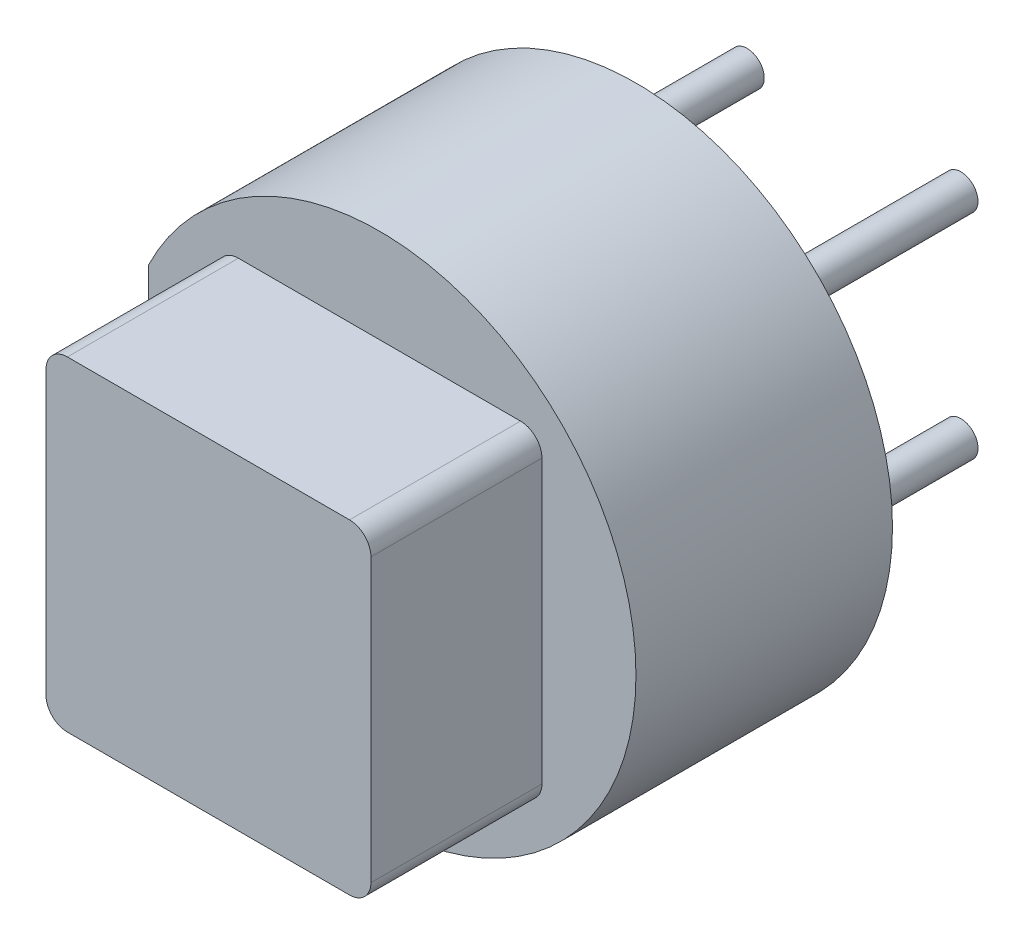
ISO-10303-21;
HEADER;
FILE_DESCRIPTION(('STEP AP214'),'2;1');
FILE_NAME('part.step','',(''),(''),'','','');
FILE_SCHEMA(('AUTOMOTIVE_DESIGN { 1 0 10303 214 1 1 1 1 }'));
ENDSEC;
DATA;
#1=APPLICATION_CONTEXT('core data for automotive mechanical design processes');
#2=APPLICATION_PROTOCOL_DEFINITION('international standard','automotive_design',2000,#1);
#3=PRODUCT_CONTEXT('',#1,'mechanical');
#4=PRODUCT('Part','Part','',(#3));
#5=PRODUCT_RELATED_PRODUCT_CATEGORY('part','',(#4));
#6=PRODUCT_DEFINITION_FORMATION('','',#4);
#7=PRODUCT_DEFINITION_CONTEXT('part definition',#1,'design');
#8=PRODUCT_DEFINITION('design','',#6,#7);
#9=PRODUCT_DEFINITION_SHAPE('','',#8);
#10=(LENGTH_UNIT() NAMED_UNIT(*) SI_UNIT(.MILLI.,.METRE.));
#11=(NAMED_UNIT(*) PLANE_ANGLE_UNIT() SI_UNIT($,.RADIAN.));
#12=(NAMED_UNIT(*) SI_UNIT($,.STERADIAN.) SOLID_ANGLE_UNIT());
#13=UNCERTAINTY_MEASURE_WITH_UNIT(LENGTH_MEASURE(1.E-05),#10,'distance_accuracy_value','');
#14=(GEOMETRIC_REPRESENTATION_CONTEXT(3) GLOBAL_UNCERTAINTY_ASSIGNED_CONTEXT((#13)) GLOBAL_UNIT_ASSIGNED_CONTEXT((#10,
#11,#12)) REPRESENTATION_CONTEXT('',''));
#15=CARTESIAN_POINT('',(0.,0.,0.));
#16=DIRECTION('',(0.,0.,1.));
#17=DIRECTION('',(1.,0.,0.));
#18=AXIS2_PLACEMENT_3D('',#15,#16,#17);
#19=CARTESIAN_POINT('',(0.,0.,6.));
#20=DIRECTION('',(0.,0.,-1.));
#21=DIRECTION('',(-1.,0.,0.));
#22=AXIS2_PLACEMENT_3D('',#19,#20,#21);
#23=PLANE('',#22);
#24=CARTESIAN_POINT('',(0.,0.,6.));
#25=DIRECTION('',(0.,0.,1.));
#26=DIRECTION('',(-1.,0.,0.));
#27=AXIS2_PLACEMENT_3D('',#24,#25,#26);
#28=CIRCLE('',#27,6.);
#29=CARTESIAN_POINT('',(-5.4,-2.6153393661244,6.));
#30=VERTEX_POINT('',#29);
#31=CARTESIAN_POINT('',(-5.4,2.6153393661244,6.));
#32=VERTEX_POINT('',#31);
#33=EDGE_CURVE('E193',#30,#32,#28,.T.);
#34=ORIENTED_EDGE('',*,*,#33,.T.);
#35=DIRECTION('',(0.,-1.,0.));
#36=VECTOR('',#35,1.);
#37=CARTESIAN_POINT('',(-5.4,2.6153393661244,6.));
#38=LINE('',#37,#36);
#39=EDGE_CURVE('E197',#32,#30,#38,.T.);
#40=ORIENTED_EDGE('',*,*,#39,.T.);
#41=EDGE_LOOP('',(#34,#40));
#42=FACE_BOUND('',#41,.T.);
#43=DIRECTION('',(0.,1.,0.));
#44=VECTOR('',#43,1.);
#45=CARTESIAN_POINT('',(3.8,-3.8,6.));
#46=LINE('',#45,#44);
#47=CARTESIAN_POINT('',(3.8,-3.3,6.));
#48=VERTEX_POINT('',#47);
#49=CARTESIAN_POINT('',(3.8,3.3,6.));
#50=VERTEX_POINT('',#49);
#51=EDGE_CURVE('E160',#48,#50,#46,.T.);
#52=ORIENTED_EDGE('',*,*,#51,.F.);
#53=CARTESIAN_POINT('',(3.3,-3.3,6.));
#54=DIRECTION('',(0.,0.,-1.));
#55=DIRECTION('',(-1.,0.,0.));
#56=AXIS2_PLACEMENT_3D('',#53,#54,#55);
#57=CIRCLE('',#56,0.5);
#58=CARTESIAN_POINT('',(3.3,-3.8,6.));
#59=VERTEX_POINT('',#58);
#60=EDGE_CURVE('E11',#48,#59,#57,.T.);
#61=ORIENTED_EDGE('',*,*,#60,.T.);
#62=DIRECTION('',(1.,0.,0.));
#63=VECTOR('',#62,1.);
#64=CARTESIAN_POINT('',(-3.8,-3.8,6.));
#65=LINE('',#64,#63);
#66=CARTESIAN_POINT('',(-3.3,-3.8,6.));
#67=VERTEX_POINT('',#66);
#68=EDGE_CURVE('E167',#67,#59,#65,.T.);
#69=ORIENTED_EDGE('',*,*,#68,.F.);
#70=CARTESIAN_POINT('',(-3.3,-3.3,6.));
#71=DIRECTION('',(0.,0.,-1.));
#72=DIRECTION('',(-1.,0.,0.));
#73=AXIS2_PLACEMENT_3D('',#70,#71,#72);
#74=CIRCLE('',#73,0.5);
#75=CARTESIAN_POINT('',(-3.8,-3.3,6.));
#76=VERTEX_POINT('',#75);
#77=EDGE_CURVE('E289',#67,#76,#74,.T.);
#78=ORIENTED_EDGE('',*,*,#77,.T.);
#79=DIRECTION('',(0.,-1.,0.));
#80=VECTOR('',#79,1.);
#81=CARTESIAN_POINT('',(-3.8,-3.8,6.));
#82=LINE('',#81,#80);
#83=CARTESIAN_POINT('',(-3.8,3.3,6.));
#84=VERTEX_POINT('',#83);
#85=EDGE_CURVE('E186',#84,#76,#82,.T.);
#86=ORIENTED_EDGE('',*,*,#85,.F.);
#87=CARTESIAN_POINT('',(-3.3,3.3,6.));
#88=DIRECTION('',(0.,0.,-1.));
#89=DIRECTION('',(-1.,0.,0.));
#90=AXIS2_PLACEMENT_3D('',#87,#88,#89);
#91=CIRCLE('',#90,0.5);
#92=CARTESIAN_POINT('',(-3.3,3.8,6.));
#93=VERTEX_POINT('',#92);
#94=EDGE_CURVE('E292',#84,#93,#91,.T.);
#95=ORIENTED_EDGE('',*,*,#94,.T.);
#96=DIRECTION('',(-1.,0.,0.));
#97=VECTOR('',#96,1.);
#98=CARTESIAN_POINT('',(-3.8,3.8,6.));
#99=LINE('',#98,#97);
#100=CARTESIAN_POINT('',(3.3,3.8,6.));
#101=VERTEX_POINT('',#100);
#102=EDGE_CURVE('E182',#101,#93,#99,.T.);
#103=ORIENTED_EDGE('',*,*,#102,.F.);
#104=CARTESIAN_POINT('',(3.3,3.3,6.));
#105=DIRECTION('',(0.,0.,-1.));
#106=DIRECTION('',(-1.,0.,0.));
#107=AXIS2_PLACEMENT_3D('',#104,#105,#106);
#108=CIRCLE('',#107,0.5);
#109=EDGE_CURVE('E49',#101,#50,#108,.T.);
#110=ORIENTED_EDGE('',*,*,#109,.T.);
#111=EDGE_LOOP('',(#52,#61,#69,#78,#86,#95,#103,#110));
#112=FACE_BOUND('',#111,.T.);
#113=ADVANCED_FACE('F40',(#42,#112),#23,.F.);
#114=CARTESIAN_POINT('',(0.,0.,6.));
#115=DIRECTION('',(0.,0.,-1.));
#116=DIRECTION('',(-1.,0.,0.));
#117=AXIS2_PLACEMENT_3D('',#114,#115,#116);
#118=CYLINDRICAL_SURFACE('',#117,6.);
#119=CARTESIAN_POINT('',(0.,0.,0.));
#120=DIRECTION('',(0.,0.,1.));
#121=DIRECTION('',(-1.,0.,0.));
#122=AXIS2_PLACEMENT_3D('',#119,#120,#121);
#123=CIRCLE('',#122,6.);
#124=CARTESIAN_POINT('',(-5.4,-2.6153393661244,0.));
#125=VERTEX_POINT('',#124);
#126=CARTESIAN_POINT('',(-5.4,2.6153393661244,0.));
#127=VERTEX_POINT('',#126);
#128=EDGE_CURVE('E179',#125,#127,#123,.T.);
#129=ORIENTED_EDGE('',*,*,#128,.T.);
#130=DIRECTION('',(0.,0.,-1.));
#131=VECTOR('',#130,1.);
#132=CARTESIAN_POINT('',(-5.4,2.6153393661244,6.));
#133=LINE('',#132,#131);
#134=EDGE_CURVE('E210',#32,#127,#133,.T.);
#135=ORIENTED_EDGE('',*,*,#134,.F.);
#136=ORIENTED_EDGE('',*,*,#33,.F.);
#137=DIRECTION('',(0.,0.,-1.));
#138=VECTOR('',#137,1.);
#139=CARTESIAN_POINT('',(-5.4,-2.6153393661244,6.));
#140=LINE('',#139,#138);
#141=EDGE_CURVE('E201',#30,#125,#140,.T.);
#142=ORIENTED_EDGE('',*,*,#141,.T.);
#143=EDGE_LOOP('',(#129,#135,#136,#142));
#144=FACE_BOUND('',#143,.T.);
#145=ADVANCED_FACE('F334',(#144),#118,.T.);
#146=CARTESIAN_POINT('',(-5.4,2.6153393661244,6.));
#147=DIRECTION('',(1.,0.,0.));
#148=DIRECTION('',(0.,0.,-1.));
#149=AXIS2_PLACEMENT_3D('',#146,#147,#148);
#150=PLANE('',#149);
#151=DIRECTION('',(0.,-1.,0.));
#152=VECTOR('',#151,1.);
#153=CARTESIAN_POINT('',(-5.4,2.6153393661244,0.));
#154=LINE('',#153,#152);
#155=EDGE_CURVE('E198',#127,#125,#154,.T.);
#156=ORIENTED_EDGE('',*,*,#155,.T.);
#157=ORIENTED_EDGE('',*,*,#141,.F.);
#158=ORIENTED_EDGE('',*,*,#39,.F.);
#159=ORIENTED_EDGE('',*,*,#134,.T.);
#160=EDGE_LOOP('',(#156,#157,#158,#159));
#161=FACE_BOUND('',#160,.T.);
#162=ADVANCED_FACE('F341',(#161),#150,.F.);
#163=CARTESIAN_POINT('',(0.,0.,0.));
#164=DIRECTION('',(0.,0.,-1.));
#165=DIRECTION('',(-1.,0.,0.));
#166=AXIS2_PLACEMENT_3D('',#163,#164,#165);
#167=PLANE('',#166);
#168=CARTESIAN_POINT('',(0.,0.,0.));
#169=DIRECTION('',(0.,0.,-1.));
#170=DIRECTION('',(1.,0.,0.));
#171=AXIS2_PLACEMENT_3D('',#168,#169,#170);
#172=CIRCLE('',#171,5.4);
#173=CARTESIAN_POINT('',(-4.8,2.4738633753706,0.));
#174=VERTEX_POINT('',#173);
#175=CARTESIAN_POINT('',(-4.8,-2.4738633753706,0.));
#176=VERTEX_POINT('',#175);
#177=EDGE_CURVE('E135',#174,#176,#172,.T.);
#178=ORIENTED_EDGE('',*,*,#177,.F.);
#179=DIRECTION('',(0.,1.,0.));
#180=VECTOR('',#179,1.);
#181=CARTESIAN_POINT('',(-4.8,-2.4738633753706,0.));
#182=LINE('',#181,#180);
#183=EDGE_CURVE('E147',#176,#174,#182,.T.);
#184=ORIENTED_EDGE('',*,*,#183,.F.);
#185=EDGE_LOOP('',(#178,#184));
#186=FACE_BOUND('',#185,.T.);
#187=ORIENTED_EDGE('',*,*,#128,.F.);
#188=ORIENTED_EDGE('',*,*,#155,.F.);
#189=EDGE_LOOP('',(#187,#188));
#190=FACE_BOUND('',#189,.T.);
#191=ADVANCED_FACE('F347',(#186,#190),#167,.T.);
#192=CARTESIAN_POINT('',(3.8,-3.8,10.));
#193=DIRECTION('',(-1.,0.,0.));
#194=DIRECTION('',(0.,0.,1.));
#195=AXIS2_PLACEMENT_3D('',#192,#193,#194);
#196=PLANE('',#195);
#197=ORIENTED_EDGE('',*,*,#51,.T.);
#198=DIRECTION('',(0.,0.,-1.));
#199=VECTOR('',#198,1.);
#200=CARTESIAN_POINT('',(3.8,3.3,10.));
#201=LINE('',#200,#199);
#202=CARTESIAN_POINT('',(3.8,3.3,10.));
#203=VERTEX_POINT('',#202);
#204=EDGE_CURVE('E286',#50,#203,#201,.F.);
#205=ORIENTED_EDGE('',*,*,#204,.T.);
#206=DIRECTION('',(0.,1.,0.));
#207=VECTOR('',#206,1.);
#208=CARTESIAN_POINT('',(3.8,-3.8,10.));
#209=LINE('',#208,#207);
#210=CARTESIAN_POINT('',(3.8,-3.3,10.));
#211=VERTEX_POINT('',#210);
#212=EDGE_CURVE('E162',#211,#203,#209,.T.);
#213=ORIENTED_EDGE('',*,*,#212,.F.);
#214=DIRECTION('',(0.,0.,-1.));
#215=VECTOR('',#214,1.);
#216=CARTESIAN_POINT('',(3.8,-3.3,10.));
#217=LINE('',#216,#215);
#218=EDGE_CURVE('E283',#211,#48,#217,.T.);
#219=ORIENTED_EDGE('',*,*,#218,.T.);
#220=EDGE_LOOP('',(#197,#205,#213,#219));
#221=FACE_BOUND('',#220,.T.);
#222=ADVANCED_FACE('F323',(#221),#196,.F.);
#223=CARTESIAN_POINT('',(-3.8,3.8,10.));
#224=DIRECTION('',(0.,-1.,0.));
#225=DIRECTION('',(0.,0.,-1.));
#226=AXIS2_PLACEMENT_3D('',#223,#224,#225);
#227=PLANE('',#226);
#228=ORIENTED_EDGE('',*,*,#102,.T.);
#229=DIRECTION('',(0.,0.,-1.));
#230=VECTOR('',#229,1.);
#231=CARTESIAN_POINT('',(-3.3,3.8,10.));
#232=LINE('',#231,#230);
#233=CARTESIAN_POINT('',(-3.3,3.8,10.));
#234=VERTEX_POINT('',#233);
#235=EDGE_CURVE('E280',#93,#234,#232,.F.);
#236=ORIENTED_EDGE('',*,*,#235,.T.);
#237=DIRECTION('',(-1.,0.,0.));
#238=VECTOR('',#237,1.);
#239=CARTESIAN_POINT('',(-3.8,3.8,10.));
#240=LINE('',#239,#238);
#241=CARTESIAN_POINT('',(3.3,3.8,10.));
#242=VERTEX_POINT('',#241);
#243=EDGE_CURVE('E166',#242,#234,#240,.T.);
#244=ORIENTED_EDGE('',*,*,#243,.F.);
#245=DIRECTION('',(0.,0.,-1.));
#246=VECTOR('',#245,1.);
#247=CARTESIAN_POINT('',(3.3,3.8,10.));
#248=LINE('',#247,#246);
#249=EDGE_CURVE('E276',#242,#101,#248,.T.);
#250=ORIENTED_EDGE('',*,*,#249,.T.);
#251=EDGE_LOOP('',(#228,#236,#244,#250));
#252=FACE_BOUND('',#251,.T.);
#253=ADVANCED_FACE('F300',(#252),#227,.F.);
#254=CARTESIAN_POINT('',(-3.8,-3.8,10.));
#255=DIRECTION('',(1.,0.,0.));
#256=DIRECTION('',(0.,0.,-1.));
#257=AXIS2_PLACEMENT_3D('',#254,#255,#256);
#258=PLANE('',#257);
#259=ORIENTED_EDGE('',*,*,#85,.T.);
#260=DIRECTION('',(0.,0.,-1.));
#261=VECTOR('',#260,1.);
#262=CARTESIAN_POINT('',(-3.8,-3.3,10.));
#263=LINE('',#262,#261);
#264=CARTESIAN_POINT('',(-3.8,-3.3,10.));
#265=VERTEX_POINT('',#264);
#266=EDGE_CURVE('E261',#76,#265,#263,.F.);
#267=ORIENTED_EDGE('',*,*,#266,.T.);
#268=DIRECTION('',(0.,-1.,0.));
#269=VECTOR('',#268,1.);
#270=CARTESIAN_POINT('',(-3.8,-3.8,10.));
#271=LINE('',#270,#269);
#272=CARTESIAN_POINT('',(-3.8,3.3,10.));
#273=VERTEX_POINT('',#272);
#274=EDGE_CURVE('E171',#273,#265,#271,.T.);
#275=ORIENTED_EDGE('',*,*,#274,.F.);
#276=DIRECTION('',(0.,0.,-1.));
#277=VECTOR('',#276,1.);
#278=CARTESIAN_POINT('',(-3.8,3.3,10.));
#279=LINE('',#278,#277);
#280=EDGE_CURVE('E257',#273,#84,#279,.T.);
#281=ORIENTED_EDGE('',*,*,#280,.T.);
#282=EDGE_LOOP('',(#259,#267,#275,#281));
#283=FACE_BOUND('',#282,.T.);
#284=ADVANCED_FACE('F310',(#283),#258,.F.);
#285=CARTESIAN_POINT('',(-3.8,-3.8,10.));
#286=DIRECTION('',(0.,1.,0.));
#287=DIRECTION('',(0.,0.,1.));
#288=AXIS2_PLACEMENT_3D('',#285,#286,#287);
#289=PLANE('',#288);
#290=DIRECTION('',(1.,0.,0.));
#291=VECTOR('',#290,1.);
#292=CARTESIAN_POINT('',(-3.8,-3.8,10.));
#293=LINE('',#292,#291);
#294=CARTESIAN_POINT('',(-3.3,-3.8,10.));
#295=VERTEX_POINT('',#294);
#296=CARTESIAN_POINT('',(3.3,-3.8,10.));
#297=VERTEX_POINT('',#296);
#298=EDGE_CURVE('E175',#295,#297,#293,.T.);
#299=ORIENTED_EDGE('',*,*,#298,.F.);
#300=DIRECTION('',(0.,0.,-1.));
#301=VECTOR('',#300,1.);
#302=CARTESIAN_POINT('',(-3.3,-3.8,10.));
#303=LINE('',#302,#301);
#304=EDGE_CURVE('E253',#295,#67,#303,.T.);
#305=ORIENTED_EDGE('',*,*,#304,.T.);
#306=ORIENTED_EDGE('',*,*,#68,.T.);
#307=DIRECTION('',(0.,0.,-1.));
#308=VECTOR('',#307,1.);
#309=CARTESIAN_POINT('',(3.3,-3.8,10.));
#310=LINE('',#309,#308);
#311=EDGE_CURVE('E250',#59,#297,#310,.F.);
#312=ORIENTED_EDGE('',*,*,#311,.T.);
#313=EDGE_LOOP('',(#299,#305,#306,#312));
#314=FACE_BOUND('',#313,.T.);
#315=ADVANCED_FACE('F318',(#314),#289,.F.);
#316=CARTESIAN_POINT('',(0.,0.,10.));
#317=DIRECTION('',(0.,0.,-1.));
#318=DIRECTION('',(-1.,0.,0.));
#319=AXIS2_PLACEMENT_3D('',#316,#317,#318);
#320=PLANE('',#319);
#321=ORIENTED_EDGE('',*,*,#274,.T.);
#322=CARTESIAN_POINT('',(-3.3,-3.3,10.));
#323=DIRECTION('',(0.,0.,-1.));
#324=DIRECTION('',(-1.,0.,0.));
#325=AXIS2_PLACEMENT_3D('',#322,#323,#324);
#326=CIRCLE('',#325,0.5);
#327=EDGE_CURVE('E273',#265,#295,#326,.F.);
#328=ORIENTED_EDGE('',*,*,#327,.T.);
#329=ORIENTED_EDGE('',*,*,#298,.T.);
#330=CARTESIAN_POINT('',(3.3,-3.3,10.));
#331=DIRECTION('',(0.,0.,-1.));
#332=DIRECTION('',(-1.,0.,0.));
#333=AXIS2_PLACEMENT_3D('',#330,#331,#332);
#334=CIRCLE('',#333,0.5);
#335=EDGE_CURVE('E264',#297,#211,#334,.F.);
#336=ORIENTED_EDGE('',*,*,#335,.T.);
#337=ORIENTED_EDGE('',*,*,#212,.T.);
#338=CARTESIAN_POINT('',(3.3,3.3,10.));
#339=DIRECTION('',(0.,0.,-1.));
#340=DIRECTION('',(-1.,0.,0.));
#341=AXIS2_PLACEMENT_3D('',#338,#339,#340);
#342=CIRCLE('',#341,0.5);
#343=EDGE_CURVE('E267',#203,#242,#342,.F.);
#344=ORIENTED_EDGE('',*,*,#343,.T.);
#345=ORIENTED_EDGE('',*,*,#243,.T.);
#346=CARTESIAN_POINT('',(-3.3,3.3,10.));
#347=DIRECTION('',(0.,0.,-1.));
#348=DIRECTION('',(-1.,0.,0.));
#349=AXIS2_PLACEMENT_3D('',#346,#347,#348);
#350=CIRCLE('',#349,0.5);
#351=EDGE_CURVE('E270',#234,#273,#350,.F.);
#352=ORIENTED_EDGE('',*,*,#351,.T.);
#353=EDGE_LOOP('',(#321,#328,#329,#336,#337,#344,#345,#352));
#354=FACE_BOUND('',#353,.T.);
#355=ADVANCED_FACE('F307',(#354),#320,.F.);
#356=CARTESIAN_POINT('',(0.,0.,0.1));
#357=DIRECTION('',(0.,0.,-1.));
#358=DIRECTION('',(-1.,0.,0.));
#359=AXIS2_PLACEMENT_3D('',#356,#357,#358);
#360=CYLINDRICAL_SURFACE('',#359,5.4);
#361=ORIENTED_EDGE('',*,*,#177,.T.);
#362=DIRECTION('',(0.,0.,-1.));
#363=VECTOR('',#362,1.);
#364=CARTESIAN_POINT('',(-4.8,-2.4738633753706,0.1));
#365=LINE('',#364,#363);
#366=CARTESIAN_POINT('',(-4.8,-2.4738633753706,0.1));
#367=VERTEX_POINT('',#366);
#368=EDGE_CURVE('E129',#367,#176,#365,.T.);
#369=ORIENTED_EDGE('',*,*,#368,.F.);
#370=CARTESIAN_POINT('',(0.,0.,0.1));
#371=DIRECTION('',(0.,0.,-1.));
#372=DIRECTION('',(1.,0.,0.));
#373=AXIS2_PLACEMENT_3D('',#370,#371,#372);
#374=CIRCLE('',#373,5.4);
#375=CARTESIAN_POINT('',(-4.8,2.4738633753706,0.1));
#376=VERTEX_POINT('',#375);
#377=EDGE_CURVE('E132',#376,#367,#374,.T.);
#378=ORIENTED_EDGE('',*,*,#377,.F.);
#379=DIRECTION('',(0.,0.,-1.));
#380=VECTOR('',#379,1.);
#381=CARTESIAN_POINT('',(-4.8,2.4738633753706,0.1));
#382=LINE('',#381,#380);
#383=EDGE_CURVE('E141',#376,#174,#382,.T.);
#384=ORIENTED_EDGE('',*,*,#383,.T.);
#385=EDGE_LOOP('',(#361,#369,#378,#384));
#386=FACE_BOUND('',#385,.T.);
#387=ADVANCED_FACE('F131',(#386),#360,.F.);
#388=CARTESIAN_POINT('',(-4.8,-2.4738633753706,0.1));
#389=DIRECTION('',(-1.,0.,0.));
#390=DIRECTION('',(0.,0.,1.));
#391=AXIS2_PLACEMENT_3D('',#388,#389,#390);
#392=PLANE('',#391);
#393=ORIENTED_EDGE('',*,*,#183,.T.);
#394=ORIENTED_EDGE('',*,*,#383,.F.);
#395=DIRECTION('',(0.,1.,0.));
#396=VECTOR('',#395,1.);
#397=CARTESIAN_POINT('',(-4.8,-2.4738633753706,0.1));
#398=LINE('',#397,#396);
#399=EDGE_CURVE('E142',#367,#376,#398,.T.);
#400=ORIENTED_EDGE('',*,*,#399,.F.);
#401=ORIENTED_EDGE('',*,*,#368,.T.);
#402=EDGE_LOOP('',(#393,#394,#400,#401));
#403=FACE_BOUND('',#402,.T.);
#404=ADVANCED_FACE('F149',(#403),#392,.F.);
#405=CARTESIAN_POINT('',(0.,0.,0.1));
#406=DIRECTION('',(0.,0.,1.));
#407=DIRECTION('',(1.,0.,0.));
#408=AXIS2_PLACEMENT_3D('',#405,#406,#407);
#409=PLANE('',#408);
#410=CARTESIAN_POINT('',(-2.5,2.5,0.1));
#411=DIRECTION('',(0.,0.,1.));
#412=DIRECTION('',(1.,0.,0.));
#413=AXIS2_PLACEMENT_3D('',#410,#411,#412);
#414=CIRCLE('',#413,0.4);
#415=CARTESIAN_POINT('',(-2.1,2.5,0.1));
#416=VERTEX_POINT('',#415);
#417=EDGE_CURVE('E246',#416,#416,#414,.F.);
#418=ORIENTED_EDGE('',*,*,#417,.F.);
#419=EDGE_LOOP('',(#418));
#420=FACE_BOUND('',#419,.T.);
#421=CARTESIAN_POINT('',(2.5,2.5,0.1));
#422=DIRECTION('',(0.,0.,1.));
#423=DIRECTION('',(1.,0.,0.));
#424=AXIS2_PLACEMENT_3D('',#421,#422,#423);
#425=CIRCLE('',#424,0.4);
#426=CARTESIAN_POINT('',(2.9,2.5,0.1));
#427=VERTEX_POINT('',#426);
#428=EDGE_CURVE('E242',#427,#427,#425,.F.);
#429=ORIENTED_EDGE('',*,*,#428,.F.);
#430=EDGE_LOOP('',(#429));
#431=FACE_BOUND('',#430,.T.);
#432=CARTESIAN_POINT('',(2.5,-2.5,0.1));
#433=DIRECTION('',(0.,0.,1.));
#434=DIRECTION('',(1.,0.,0.));
#435=AXIS2_PLACEMENT_3D('',#432,#433,#434);
#436=CIRCLE('',#435,0.4);
#437=CARTESIAN_POINT('',(2.9,-2.5,0.1));
#438=VERTEX_POINT('',#437);
#439=EDGE_CURVE('E238',#438,#438,#436,.F.);
#440=ORIENTED_EDGE('',*,*,#439,.F.);
#441=EDGE_LOOP('',(#440));
#442=FACE_BOUND('',#441,.T.);
#443=CARTESIAN_POINT('',(-2.5,-2.5,0.1));
#444=DIRECTION('',(0.,0.,1.));
#445=DIRECTION('',(1.,0.,0.));
#446=AXIS2_PLACEMENT_3D('',#443,#444,#445);
#447=CIRCLE('',#446,0.4);
#448=CARTESIAN_POINT('',(-2.1,-2.5,0.1));
#449=VERTEX_POINT('',#448);
#450=EDGE_CURVE('E234',#449,#449,#447,.F.);
#451=ORIENTED_EDGE('',*,*,#450,.F.);
#452=EDGE_LOOP('',(#451));
#453=FACE_BOUND('',#452,.T.);
#454=CARTESIAN_POINT('',(-4.,0.,0.1));
#455=DIRECTION('',(0.,0.,1.));
#456=DIRECTION('',(1.,0.,0.));
#457=AXIS2_PLACEMENT_3D('',#454,#455,#456);
#458=CIRCLE('',#457,0.6);
#459=CARTESIAN_POINT('',(-3.4,0.,0.1));
#460=VERTEX_POINT('',#459);
#461=EDGE_CURVE('E230',#460,#460,#458,.F.);
#462=ORIENTED_EDGE('',*,*,#461,.F.);
#463=EDGE_LOOP('',(#462));
#464=FACE_BOUND('',#463,.T.);
#465=CARTESIAN_POINT('',(0.,4.,0.1));
#466=DIRECTION('',(0.,0.,1.));
#467=DIRECTION('',(1.,0.,0.));
#468=AXIS2_PLACEMENT_3D('',#465,#466,#467);
#469=CIRCLE('',#468,0.6);
#470=CARTESIAN_POINT('',(0.6,4.,0.1));
#471=VERTEX_POINT('',#470);
#472=EDGE_CURVE('E226',#471,#471,#469,.F.);
#473=ORIENTED_EDGE('',*,*,#472,.F.);
#474=EDGE_LOOP('',(#473));
#475=FACE_BOUND('',#474,.T.);
#476=CARTESIAN_POINT('',(4.,0.,0.1));
#477=DIRECTION('',(0.,0.,1.));
#478=DIRECTION('',(1.,0.,0.));
#479=AXIS2_PLACEMENT_3D('',#476,#477,#478);
#480=CIRCLE('',#479,0.6);
#481=CARTESIAN_POINT('',(4.6,0.,0.1));
#482=VERTEX_POINT('',#481);
#483=EDGE_CURVE('E222',#482,#482,#480,.F.);
#484=ORIENTED_EDGE('',*,*,#483,.F.);
#485=EDGE_LOOP('',(#484));
#486=FACE_BOUND('',#485,.T.);
#487=CARTESIAN_POINT('',(0.,-4.,0.1));
#488=DIRECTION('',(0.,0.,1.));
#489=DIRECTION('',(1.,0.,0.));
#490=AXIS2_PLACEMENT_3D('',#487,#488,#489);
#491=CIRCLE('',#490,0.6);
#492=CARTESIAN_POINT('',(0.6,-4.,0.1));
#493=VERTEX_POINT('',#492);
#494=EDGE_CURVE('E218',#493,#493,#491,.F.);
#495=ORIENTED_EDGE('',*,*,#494,.F.);
#496=EDGE_LOOP('',(#495));
#497=FACE_BOUND('',#496,.T.);
#498=CARTESIAN_POINT('',(0.,0.,0.1));
#499=DIRECTION('',(0.,0.,1.));
#500=DIRECTION('',(1.,0.,0.));
#501=AXIS2_PLACEMENT_3D('',#498,#499,#500);
#502=CIRCLE('',#501,1.5);
#503=CARTESIAN_POINT('',(1.5,0.,0.1));
#504=VERTEX_POINT('',#503);
#505=EDGE_CURVE('E214',#504,#504,#502,.F.);
#506=ORIENTED_EDGE('',*,*,#505,.F.);
#507=EDGE_LOOP('',(#506));
#508=FACE_BOUND('',#507,.T.);
#509=ORIENTED_EDGE('',*,*,#377,.T.);
#510=ORIENTED_EDGE('',*,*,#399,.T.);
#511=EDGE_LOOP('',(#509,#510));
#512=FACE_BOUND('',#511,.T.);
#513=ADVANCED_FACE('F145',(#420,#431,#442,#453,#464,#475,#486,#497,#508,#512),#409,.F.);
#514=CARTESIAN_POINT('',(0.,0.,-1.1));
#515=DIRECTION('',(0.,0.,1.));
#516=DIRECTION('',(1.,0.,0.));
#517=AXIS2_PLACEMENT_3D('',#514,#515,#516);
#518=CYLINDRICAL_SURFACE('',#517,1.5);
#519=CARTESIAN_POINT('',(0.,0.,-1.1));
#520=DIRECTION('',(0.,0.,-1.));
#521=DIRECTION('',(-1.,0.,0.));
#522=AXIS2_PLACEMENT_3D('',#519,#520,#521);
#523=CIRCLE('',#522,1.5);
#524=CARTESIAN_POINT('',(-1.5,0.,-1.1));
#525=VERTEX_POINT('',#524);
#526=EDGE_CURVE('E156',#525,#525,#523,.T.);
#527=ORIENTED_EDGE('',*,*,#526,.F.);
#528=EDGE_LOOP('',(#527));
#529=FACE_BOUND('',#528,.T.);
#530=ORIENTED_EDGE('',*,*,#505,.T.);
#531=EDGE_LOOP('',(#530));
#532=FACE_BOUND('',#531,.T.);
#533=ADVANCED_FACE('F428',(#529,#532),#518,.T.);
#534=CARTESIAN_POINT('',(0.,0.,-1.1));
#535=DIRECTION('',(0.,0.,-1.));
#536=DIRECTION('',(-1.,0.,0.));
#537=AXIS2_PLACEMENT_3D('',#534,#535,#536);
#538=PLANE('',#537);
#539=ORIENTED_EDGE('',*,*,#526,.T.);
#540=EDGE_LOOP('',(#539));
#541=FACE_BOUND('',#540,.T.);
#542=ADVANCED_FACE('F424',(#541),#538,.T.);
#543=CARTESIAN_POINT('',(0.,-4.,-1.1));
#544=DIRECTION('',(0.,0.,1.));
#545=DIRECTION('',(1.,0.,0.));
#546=AXIS2_PLACEMENT_3D('',#543,#544,#545);
#547=CYLINDRICAL_SURFACE('',#546,0.6);
#548=CARTESIAN_POINT('',(0.,-4.,-1.1));
#549=DIRECTION('',(0.,0.,-1.));
#550=DIRECTION('',(-1.,0.,0.));
#551=AXIS2_PLACEMENT_3D('',#548,#549,#550);
#552=CIRCLE('',#551,0.6);
#553=CARTESIAN_POINT('',(-0.6,-4.,-1.1));
#554=VERTEX_POINT('',#553);
#555=EDGE_CURVE('E711',#554,#554,#552,.T.);
#556=ORIENTED_EDGE('',*,*,#555,.F.);
#557=EDGE_LOOP('',(#556));
#558=FACE_BOUND('',#557,.T.);
#559=ORIENTED_EDGE('',*,*,#494,.T.);
#560=EDGE_LOOP('',(#559));
#561=FACE_BOUND('',#560,.T.);
#562=ADVANCED_FACE('F420',(#558,#561),#547,.T.);
#563=CARTESIAN_POINT('',(0.,-4.,-1.1));
#564=DIRECTION('',(0.,0.,-1.));
#565=DIRECTION('',(-1.,0.,0.));
#566=AXIS2_PLACEMENT_3D('',#563,#564,#565);
#567=PLANE('',#566);
#568=ORIENTED_EDGE('',*,*,#555,.T.);
#569=EDGE_LOOP('',(#568));
#570=FACE_BOUND('',#569,.T.);
#571=ADVANCED_FACE('F416',(#570),#567,.T.);
#572=CARTESIAN_POINT('',(4.,0.,-1.1));
#573=DIRECTION('',(0.,0.,1.));
#574=DIRECTION('',(1.,0.,0.));
#575=AXIS2_PLACEMENT_3D('',#572,#573,#574);
#576=CYLINDRICAL_SURFACE('',#575,0.6);
#577=CARTESIAN_POINT('',(4.,0.,-1.1));
#578=DIRECTION('',(0.,0.,-1.));
#579=DIRECTION('',(-1.,0.,0.));
#580=AXIS2_PLACEMENT_3D('',#577,#578,#579);
#581=CIRCLE('',#580,0.6);
#582=CARTESIAN_POINT('',(3.4,0.,-1.1));
#583=VERTEX_POINT('',#582);
#584=EDGE_CURVE('E714',#583,#583,#581,.T.);
#585=ORIENTED_EDGE('',*,*,#584,.F.);
#586=EDGE_LOOP('',(#585));
#587=FACE_BOUND('',#586,.T.);
#588=ORIENTED_EDGE('',*,*,#483,.T.);
#589=EDGE_LOOP('',(#588));
#590=FACE_BOUND('',#589,.T.);
#591=ADVANCED_FACE('F412',(#587,#590),#576,.T.);
#592=CARTESIAN_POINT('',(4.,0.,-1.1));
#593=DIRECTION('',(0.,0.,-1.));
#594=DIRECTION('',(-1.,0.,0.));
#595=AXIS2_PLACEMENT_3D('',#592,#593,#594);
#596=PLANE('',#595);
#597=ORIENTED_EDGE('',*,*,#584,.T.);
#598=EDGE_LOOP('',(#597));
#599=FACE_BOUND('',#598,.T.);
#600=ADVANCED_FACE('F408',(#599),#596,.T.);
#601=CARTESIAN_POINT('',(0.,4.,-1.1));
#602=DIRECTION('',(0.,0.,1.));
#603=DIRECTION('',(1.,0.,0.));
#604=AXIS2_PLACEMENT_3D('',#601,#602,#603);
#605=CYLINDRICAL_SURFACE('',#604,0.6);
#606=CARTESIAN_POINT('',(0.,4.,-1.1));
#607=DIRECTION('',(0.,0.,-1.));
#608=DIRECTION('',(-1.,0.,0.));
#609=AXIS2_PLACEMENT_3D('',#606,#607,#608);
#610=CIRCLE('',#609,0.6);
#611=CARTESIAN_POINT('',(-0.6,4.,-1.1));
#612=VERTEX_POINT('',#611);
#613=EDGE_CURVE('E720',#612,#612,#610,.T.);
#614=ORIENTED_EDGE('',*,*,#613,.F.);
#615=EDGE_LOOP('',(#614));
#616=FACE_BOUND('',#615,.T.);
#617=ORIENTED_EDGE('',*,*,#472,.T.);
#618=EDGE_LOOP('',(#617));
#619=FACE_BOUND('',#618,.T.);
#620=ADVANCED_FACE('F404',(#616,#619),#605,.T.);
#621=CARTESIAN_POINT('',(0.,4.,-1.1));
#622=DIRECTION('',(0.,0.,-1.));
#623=DIRECTION('',(-1.,0.,0.));
#624=AXIS2_PLACEMENT_3D('',#621,#622,#623);
#625=PLANE('',#624);
#626=ORIENTED_EDGE('',*,*,#613,.T.);
#627=EDGE_LOOP('',(#626));
#628=FACE_BOUND('',#627,.T.);
#629=ADVANCED_FACE('F400',(#628),#625,.T.);
#630=CARTESIAN_POINT('',(-4.,0.,-1.1));
#631=DIRECTION('',(0.,0.,1.));
#632=DIRECTION('',(1.,0.,0.));
#633=AXIS2_PLACEMENT_3D('',#630,#631,#632);
#634=CYLINDRICAL_SURFACE('',#633,0.6);
#635=CARTESIAN_POINT('',(-4.,0.,-1.1));
#636=DIRECTION('',(0.,0.,-1.));
#637=DIRECTION('',(-1.,0.,0.));
#638=AXIS2_PLACEMENT_3D('',#635,#636,#637);
#639=CIRCLE('',#638,0.6);
#640=CARTESIAN_POINT('',(-4.6,0.,-1.1));
#641=VERTEX_POINT('',#640);
#642=EDGE_CURVE('E724',#641,#641,#639,.T.);
#643=ORIENTED_EDGE('',*,*,#642,.F.);
#644=EDGE_LOOP('',(#643));
#645=FACE_BOUND('',#644,.T.);
#646=ORIENTED_EDGE('',*,*,#461,.T.);
#647=EDGE_LOOP('',(#646));
#648=FACE_BOUND('',#647,.T.);
#649=ADVANCED_FACE('F396',(#645,#648),#634,.T.);
#650=CARTESIAN_POINT('',(-4.,0.,-1.1));
#651=DIRECTION('',(0.,0.,-1.));
#652=DIRECTION('',(-1.,0.,0.));
#653=AXIS2_PLACEMENT_3D('',#650,#651,#652);
#654=PLANE('',#653);
#655=ORIENTED_EDGE('',*,*,#642,.T.);
#656=EDGE_LOOP('',(#655));
#657=FACE_BOUND('',#656,.T.);
#658=ADVANCED_FACE('F392',(#657),#654,.T.);
#659=CARTESIAN_POINT('',(-2.5,-2.5,-5.1));
#660=DIRECTION('',(0.,0.,1.));
#661=DIRECTION('',(1.,0.,0.));
#662=AXIS2_PLACEMENT_3D('',#659,#660,#661);
#663=CYLINDRICAL_SURFACE('',#662,0.4);
#664=CARTESIAN_POINT('',(-2.5,-2.5,-5.1));
#665=DIRECTION('',(0.,0.,-1.));
#666=DIRECTION('',(-1.,0.,0.));
#667=AXIS2_PLACEMENT_3D('',#664,#665,#666);
#668=CIRCLE('',#667,0.4);
#669=CARTESIAN_POINT('',(-2.9,-2.5,-5.1));
#670=VERTEX_POINT('',#669);
#671=EDGE_CURVE('E728',#670,#670,#668,.T.);
#672=ORIENTED_EDGE('',*,*,#671,.F.);
#673=EDGE_LOOP('',(#672));
#674=FACE_BOUND('',#673,.T.);
#675=ORIENTED_EDGE('',*,*,#450,.T.);
#676=EDGE_LOOP('',(#675));
#677=FACE_BOUND('',#676,.T.);
#678=ADVANCED_FACE('F388',(#674,#677),#663,.T.);
#679=CARTESIAN_POINT('',(-2.5,-2.5,-5.1));
#680=DIRECTION('',(0.,0.,-1.));
#681=DIRECTION('',(-1.,0.,0.));
#682=AXIS2_PLACEMENT_3D('',#679,#680,#681);
#683=PLANE('',#682);
#684=ORIENTED_EDGE('',*,*,#671,.T.);
#685=EDGE_LOOP('',(#684));
#686=FACE_BOUND('',#685,.T.);
#687=ADVANCED_FACE('F384',(#686),#683,.T.);
#688=CARTESIAN_POINT('',(2.5,-2.5,-5.1));
#689=DIRECTION('',(0.,0.,1.));
#690=DIRECTION('',(1.,0.,0.));
#691=AXIS2_PLACEMENT_3D('',#688,#689,#690);
#692=CYLINDRICAL_SURFACE('',#691,0.4);
#693=CARTESIAN_POINT('',(2.5,-2.5,-5.1));
#694=DIRECTION('',(0.,0.,-1.));
#695=DIRECTION('',(-1.,0.,0.));
#696=AXIS2_PLACEMENT_3D('',#693,#694,#695);
#697=CIRCLE('',#696,0.4);
#698=CARTESIAN_POINT('',(2.1,-2.5,-5.1));
#699=VERTEX_POINT('',#698);
#700=EDGE_CURVE('E732',#699,#699,#697,.T.);
#701=ORIENTED_EDGE('',*,*,#700,.F.);
#702=EDGE_LOOP('',(#701));
#703=FACE_BOUND('',#702,.T.);
#704=ORIENTED_EDGE('',*,*,#439,.T.);
#705=EDGE_LOOP('',(#704));
#706=FACE_BOUND('',#705,.T.);
#707=ADVANCED_FACE('F380',(#703,#706),#692,.T.);
#708=CARTESIAN_POINT('',(2.5,-2.5,-5.1));
#709=DIRECTION('',(0.,0.,-1.));
#710=DIRECTION('',(-1.,0.,0.));
#711=AXIS2_PLACEMENT_3D('',#708,#709,#710);
#712=PLANE('',#711);
#713=ORIENTED_EDGE('',*,*,#700,.T.);
#714=EDGE_LOOP('',(#713));
#715=FACE_BOUND('',#714,.T.);
#716=ADVANCED_FACE('F376',(#715),#712,.T.);
#717=CARTESIAN_POINT('',(2.5,2.5,-5.1));
#718=DIRECTION('',(0.,0.,1.));
#719=DIRECTION('',(1.,0.,0.));
#720=AXIS2_PLACEMENT_3D('',#717,#718,#719);
#721=CYLINDRICAL_SURFACE('',#720,0.4);
#722=CARTESIAN_POINT('',(2.5,2.5,-5.1));
#723=DIRECTION('',(0.,0.,-1.));
#724=DIRECTION('',(-1.,0.,0.));
#725=AXIS2_PLACEMENT_3D('',#722,#723,#724);
#726=CIRCLE('',#725,0.4);
#727=CARTESIAN_POINT('',(2.1,2.5,-5.1));
#728=VERTEX_POINT('',#727);
#729=EDGE_CURVE('E736',#728,#728,#726,.T.);
#730=ORIENTED_EDGE('',*,*,#729,.F.);
#731=EDGE_LOOP('',(#730));
#732=FACE_BOUND('',#731,.T.);
#733=ORIENTED_EDGE('',*,*,#428,.T.);
#734=EDGE_LOOP('',(#733));
#735=FACE_BOUND('',#734,.T.);
#736=ADVANCED_FACE('F372',(#732,#735),#721,.T.);
#737=CARTESIAN_POINT('',(2.5,2.5,-5.1));
#738=DIRECTION('',(0.,0.,-1.));
#739=DIRECTION('',(-1.,0.,0.));
#740=AXIS2_PLACEMENT_3D('',#737,#738,#739);
#741=PLANE('',#740);
#742=ORIENTED_EDGE('',*,*,#729,.T.);
#743=EDGE_LOOP('',(#742));
#744=FACE_BOUND('',#743,.T.);
#745=ADVANCED_FACE('F365',(#744),#741,.T.);
#746=CARTESIAN_POINT('',(-2.5,2.5,-5.1));
#747=DIRECTION('',(0.,0.,1.));
#748=DIRECTION('',(1.,0.,0.));
#749=AXIS2_PLACEMENT_3D('',#746,#747,#748);
#750=CYLINDRICAL_SURFACE('',#749,0.4);
#751=CARTESIAN_POINT('',(-2.5,2.5,-5.1));
#752=DIRECTION('',(0.,0.,-1.));
#753=DIRECTION('',(-1.,0.,0.));
#754=AXIS2_PLACEMENT_3D('',#751,#752,#753);
#755=CIRCLE('',#754,0.4);
#756=CARTESIAN_POINT('',(-2.9,2.5,-5.1));
#757=VERTEX_POINT('',#756);
#758=EDGE_CURVE('E740',#757,#757,#755,.T.);
#759=ORIENTED_EDGE('',*,*,#758,.F.);
#760=EDGE_LOOP('',(#759));
#761=FACE_BOUND('',#760,.T.);
#762=ORIENTED_EDGE('',*,*,#417,.T.);
#763=EDGE_LOOP('',(#762));
#764=FACE_BOUND('',#763,.T.);
#765=ADVANCED_FACE('F359',(#761,#764),#750,.T.);
#766=CARTESIAN_POINT('',(-2.5,2.5,-5.1));
#767=DIRECTION('',(0.,0.,-1.));
#768=DIRECTION('',(-1.,0.,0.));
#769=AXIS2_PLACEMENT_3D('',#766,#767,#768);
#770=PLANE('',#769);
#771=ORIENTED_EDGE('',*,*,#758,.T.);
#772=EDGE_LOOP('',(#771));
#773=FACE_BOUND('',#772,.T.);
#774=ADVANCED_FACE('F355',(#773),#770,.T.);
#775=CARTESIAN_POINT('',(-3.3,-3.3,10.));
#776=DIRECTION('',(0.,0.,-1.));
#777=DIRECTION('',(-1.,0.,0.));
#778=AXIS2_PLACEMENT_3D('',#775,#776,#777);
#779=CYLINDRICAL_SURFACE('',#778,0.5);
#780=ORIENTED_EDGE('',*,*,#327,.F.);
#781=ORIENTED_EDGE('',*,*,#266,.F.);
#782=ORIENTED_EDGE('',*,*,#77,.F.);
#783=ORIENTED_EDGE('',*,*,#304,.F.);
#784=EDGE_LOOP('',(#780,#781,#782,#783));
#785=FACE_BOUND('',#784,.T.);
#786=ADVANCED_FACE('F313',(#785),#779,.T.);
#787=CARTESIAN_POINT('',(-3.3,3.3,10.));
#788=DIRECTION('',(0.,0.,-1.));
#789=DIRECTION('',(-1.,0.,0.));
#790=AXIS2_PLACEMENT_3D('',#787,#788,#789);
#791=CYLINDRICAL_SURFACE('',#790,0.5);
#792=ORIENTED_EDGE('',*,*,#351,.F.);
#793=ORIENTED_EDGE('',*,*,#235,.F.);
#794=ORIENTED_EDGE('',*,*,#94,.F.);
#795=ORIENTED_EDGE('',*,*,#280,.F.);
#796=EDGE_LOOP('',(#792,#793,#794,#795));
#797=FACE_BOUND('',#796,.T.);
#798=ADVANCED_FACE('F304',(#797),#791,.T.);
#799=CARTESIAN_POINT('',(3.3,3.3,10.));
#800=DIRECTION('',(0.,0.,-1.));
#801=DIRECTION('',(-1.,0.,0.));
#802=AXIS2_PLACEMENT_3D('',#799,#800,#801);
#803=CYLINDRICAL_SURFACE('',#802,0.5);
#804=ORIENTED_EDGE('',*,*,#343,.F.);
#805=ORIENTED_EDGE('',*,*,#204,.F.);
#806=ORIENTED_EDGE('',*,*,#109,.F.);
#807=ORIENTED_EDGE('',*,*,#249,.F.);
#808=EDGE_LOOP('',(#804,#805,#806,#807));
#809=FACE_BOUND('',#808,.T.);
#810=ADVANCED_FACE('F326',(#809),#803,.T.);
#811=CARTESIAN_POINT('',(3.3,-3.3,10.));
#812=DIRECTION('',(0.,0.,-1.));
#813=DIRECTION('',(-1.,0.,0.));
#814=AXIS2_PLACEMENT_3D('',#811,#812,#813);
#815=CYLINDRICAL_SURFACE('',#814,0.5);
#816=ORIENTED_EDGE('',*,*,#335,.F.);
#817=ORIENTED_EDGE('',*,*,#311,.F.);
#818=ORIENTED_EDGE('',*,*,#60,.F.);
#819=ORIENTED_EDGE('',*,*,#218,.F.);
#820=EDGE_LOOP('',(#816,#817,#818,#819));
#821=FACE_BOUND('',#820,.T.);
#822=ADVANCED_FACE('F42',(#821),#815,.T.);
#823=CLOSED_SHELL('',(#113,#145,#162,#191,#222,#253,#284,#315,#355,#387,#404,#513,#533,#542,
#562,#571,#591,#600,#620,#629,#649,#658,#678,#687,#707,#716,#736,#745,#765,#774,#786,#798,#810,#822));
#824=MANIFOLD_SOLID_BREP('B2',#823);
#825=ADVANCED_BREP_SHAPE_REPRESENTATION('',(#18,#824),#14);
#826=SHAPE_DEFINITION_REPRESENTATION(#9,#825);
ENDSEC;
END-ISO-10303-21;
